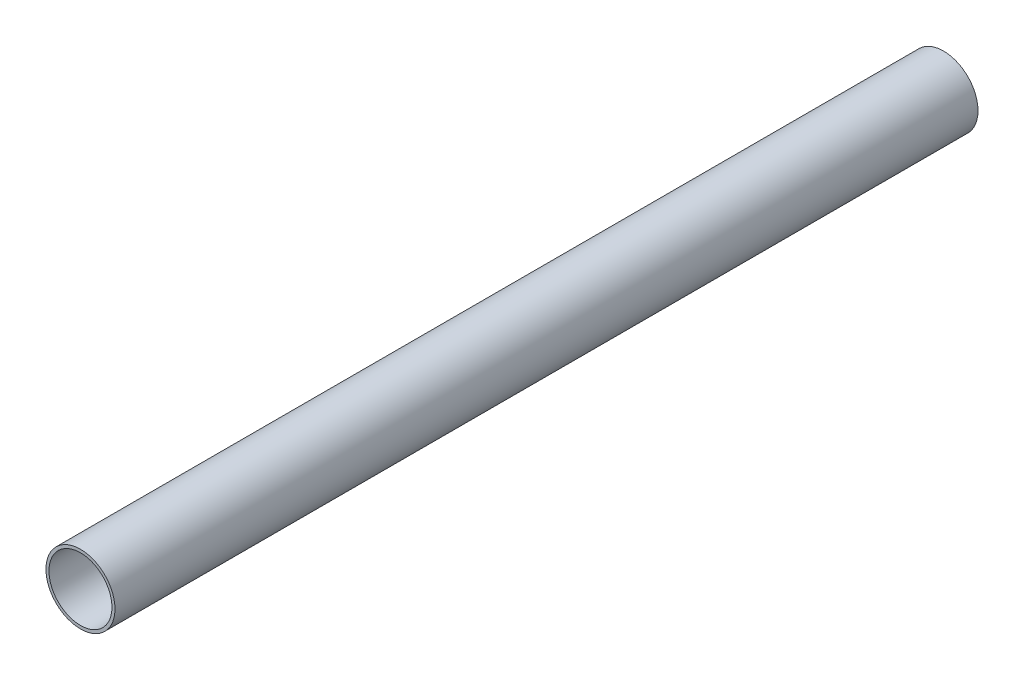
ISO-10303-21;
HEADER;
FILE_DESCRIPTION(('STEP AP214'),'2;1');
FILE_NAME('part.step','',(''),(''),'','','');
FILE_SCHEMA(('AUTOMOTIVE_DESIGN { 1 0 10303 214 1 1 1 1 }'));
ENDSEC;
DATA;
#1=APPLICATION_CONTEXT('core data for automotive mechanical design processes');
#2=APPLICATION_PROTOCOL_DEFINITION('international standard','automotive_design',2000,#1);
#3=PRODUCT_CONTEXT('',#1,'mechanical');
#4=PRODUCT('Part','Part','',(#3));
#5=PRODUCT_RELATED_PRODUCT_CATEGORY('part','',(#4));
#6=PRODUCT_DEFINITION_FORMATION('','',#4);
#7=PRODUCT_DEFINITION_CONTEXT('part definition',#1,'design');
#8=PRODUCT_DEFINITION('design','',#6,#7);
#9=PRODUCT_DEFINITION_SHAPE('','',#8);
#10=(LENGTH_UNIT() NAMED_UNIT(*) SI_UNIT(.MILLI.,.METRE.));
#11=(NAMED_UNIT(*) PLANE_ANGLE_UNIT() SI_UNIT($,.RADIAN.));
#12=(NAMED_UNIT(*) SI_UNIT($,.STERADIAN.) SOLID_ANGLE_UNIT());
#13=UNCERTAINTY_MEASURE_WITH_UNIT(LENGTH_MEASURE(1.E-05),#10,'distance_accuracy_value','');
#14=(GEOMETRIC_REPRESENTATION_CONTEXT(3) GLOBAL_UNCERTAINTY_ASSIGNED_CONTEXT((#13)) GLOBAL_UNIT_ASSIGNED_CONTEXT((#10,
#11,#12)) REPRESENTATION_CONTEXT('',''));
#15=CARTESIAN_POINT('',(0.,0.,0.));
#16=DIRECTION('',(0.,0.,1.));
#17=DIRECTION('',(1.,0.,0.));
#18=AXIS2_PLACEMENT_3D('',#15,#16,#17);
#19=CARTESIAN_POINT('',(0.,0.,300.));
#20=DIRECTION('',(0.,0.,1.));
#21=DIRECTION('',(1.,0.,0.));
#22=AXIS2_PLACEMENT_3D('',#19,#20,#21);
#23=PLANE('',#22);
#24=CARTESIAN_POINT('',(0.,0.,300.));
#25=DIRECTION('',(0.,0.,1.));
#26=DIRECTION('',(1.,0.,0.));
#27=AXIS2_PLACEMENT_3D('',#24,#25,#26);
#28=CIRCLE('',#27,12.);
#29=CARTESIAN_POINT('',(12.,0.,300.));
#30=VERTEX_POINT('',#29);
#31=EDGE_CURVE('E11',#30,#30,#28,.T.);
#32=ORIENTED_EDGE('',*,*,#31,.T.);
#33=EDGE_LOOP('',(#32));
#34=FACE_BOUND('',#33,.T.);
#35=CARTESIAN_POINT('',(0.,0.,300.));
#36=DIRECTION('',(0.,0.,1.));
#37=DIRECTION('',(1.,0.,0.));
#38=AXIS2_PLACEMENT_3D('',#35,#36,#37);
#39=CIRCLE('',#38,10.95);
#40=CARTESIAN_POINT('',(10.95,0.,300.));
#41=VERTEX_POINT('',#40);
#42=EDGE_CURVE('E52',#41,#41,#39,.T.);
#43=ORIENTED_EDGE('',*,*,#42,.F.);
#44=EDGE_LOOP('',(#43));
#45=FACE_BOUND('',#44,.T.);
#46=ADVANCED_FACE('F41',(#34,#45),#23,.T.);
#47=CARTESIAN_POINT('',(0.,0.,0.));
#48=DIRECTION('',(0.,0.,1.));
#49=DIRECTION('',(1.,0.,0.));
#50=AXIS2_PLACEMENT_3D('',#47,#48,#49);
#51=PLANE('',#50);
#52=CARTESIAN_POINT('',(0.,0.,0.));
#53=DIRECTION('',(0.,0.,1.));
#54=DIRECTION('',(1.,0.,0.));
#55=AXIS2_PLACEMENT_3D('',#52,#53,#54);
#56=CIRCLE('',#55,12.);
#57=CARTESIAN_POINT('',(12.,0.,0.));
#58=VERTEX_POINT('',#57);
#59=EDGE_CURVE('E45',#58,#58,#56,.T.);
#60=ORIENTED_EDGE('',*,*,#59,.F.);
#61=EDGE_LOOP('',(#60));
#62=FACE_BOUND('',#61,.T.);
#63=CARTESIAN_POINT('',(0.,0.,0.));
#64=DIRECTION('',(0.,0.,1.));
#65=DIRECTION('',(1.,0.,0.));
#66=AXIS2_PLACEMENT_3D('',#63,#64,#65);
#67=CIRCLE('',#66,10.95);
#68=CARTESIAN_POINT('',(10.95,0.,0.));
#69=VERTEX_POINT('',#68);
#70=EDGE_CURVE('E54',#69,#69,#67,.T.);
#71=ORIENTED_EDGE('',*,*,#70,.T.);
#72=EDGE_LOOP('',(#71));
#73=FACE_BOUND('',#72,.T.);
#74=ADVANCED_FACE('F64',(#62,#73),#51,.F.);
#75=CARTESIAN_POINT('',(0.,0.,300.));
#76=DIRECTION('',(0.,0.,-1.));
#77=DIRECTION('',(-1.,0.,0.));
#78=AXIS2_PLACEMENT_3D('',#75,#76,#77);
#79=CYLINDRICAL_SURFACE('',#78,12.);
#80=ORIENTED_EDGE('',*,*,#31,.F.);
#81=EDGE_LOOP('',(#80));
#82=FACE_BOUND('',#81,.T.);
#83=ORIENTED_EDGE('',*,*,#59,.T.);
#84=EDGE_LOOP('',(#83));
#85=FACE_BOUND('',#84,.T.);
#86=ADVANCED_FACE('F43',(#82,#85),#79,.T.);
#87=CARTESIAN_POINT('',(0.,0.,300.));
#88=DIRECTION('',(0.,0.,-1.));
#89=DIRECTION('',(-1.,0.,0.));
#90=AXIS2_PLACEMENT_3D('',#87,#88,#89);
#91=CYLINDRICAL_SURFACE('',#90,10.95);
#92=ORIENTED_EDGE('',*,*,#42,.T.);
#93=EDGE_LOOP('',(#92));
#94=FACE_BOUND('',#93,.T.);
#95=ORIENTED_EDGE('',*,*,#70,.F.);
#96=EDGE_LOOP('',(#95));
#97=FACE_BOUND('',#96,.T.);
#98=ADVANCED_FACE('F60',(#94,#97),#91,.F.);
#99=CLOSED_SHELL('',(#46,#74,#86,#98));
#100=MANIFOLD_SOLID_BREP('B2',#99);
#101=ADVANCED_BREP_SHAPE_REPRESENTATION('',(#18,#100),#14);
#102=SHAPE_DEFINITION_REPRESENTATION(#9,#101);
ENDSEC;
END-ISO-10303-21;
